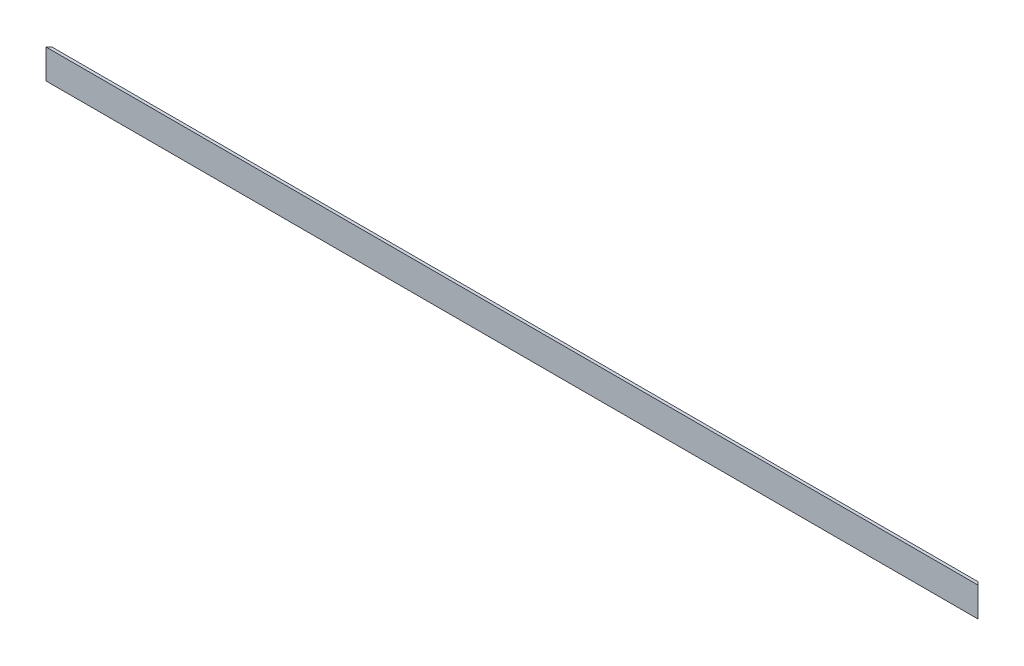
ISO-10303-21;
HEADER;
FILE_DESCRIPTION(('STEP AP214'),'2;1');
FILE_NAME('part.step','',(''),(''),'','','');
FILE_SCHEMA(('AUTOMOTIVE_DESIGN { 1 0 10303 214 1 1 1 1 }'));
ENDSEC;
DATA;
#1=APPLICATION_CONTEXT('core data for automotive mechanical design processes');
#2=APPLICATION_PROTOCOL_DEFINITION('international standard','automotive_design',2000,#1);
#3=PRODUCT_CONTEXT('',#1,'mechanical');
#4=PRODUCT('Part','Part','',(#3));
#5=PRODUCT_RELATED_PRODUCT_CATEGORY('part','',(#4));
#6=PRODUCT_DEFINITION_FORMATION('','',#4);
#7=PRODUCT_DEFINITION_CONTEXT('part definition',#1,'design');
#8=PRODUCT_DEFINITION('design','',#6,#7);
#9=PRODUCT_DEFINITION_SHAPE('','',#8);
#10=(LENGTH_UNIT() NAMED_UNIT(*) SI_UNIT(.MILLI.,.METRE.));
#11=(NAMED_UNIT(*) PLANE_ANGLE_UNIT() SI_UNIT($,.RADIAN.));
#12=(NAMED_UNIT(*) SI_UNIT($,.STERADIAN.) SOLID_ANGLE_UNIT());
#13=UNCERTAINTY_MEASURE_WITH_UNIT(LENGTH_MEASURE(1.E-05),#10,'distance_accuracy_value','');
#14=(GEOMETRIC_REPRESENTATION_CONTEXT(3) GLOBAL_UNCERTAINTY_ASSIGNED_CONTEXT((#13)) GLOBAL_UNIT_ASSIGNED_CONTEXT((#10,
#11,#12)) REPRESENTATION_CONTEXT('',''));
#15=CARTESIAN_POINT('',(0.,0.,0.));
#16=DIRECTION('',(0.,0.,1.));
#17=DIRECTION('',(1.,0.,0.));
#18=AXIS2_PLACEMENT_3D('',#15,#16,#17);
#19=CARTESIAN_POINT('',(475.,0.,-15.));
#20=DIRECTION('',(0.,1.,0.));
#21=DIRECTION('',(0.,0.,1.));
#22=AXIS2_PLACEMENT_3D('',#19,#20,#21);
#23=PLANE('',#22);
#24=DIRECTION('',(0.707106781186541,0.,-0.707106781186554));
#25=VECTOR('',#24,1.);
#26=CARTESIAN_POINT('',(0.,0.,0.));
#27=LINE('',#26,#25);
#28=CARTESIAN_POINT('',(0.,0.,0.));
#29=VERTEX_POINT('',#28);
#30=CARTESIAN_POINT('',(14.9999999999997,0.,-15.));
#31=VERTEX_POINT('',#30);
#32=EDGE_CURVE('E88',#29,#31,#27,.T.);
#33=ORIENTED_EDGE('',*,*,#32,.T.);
#34=DIRECTION('',(-1.,0.,0.));
#35=VECTOR('',#34,1.);
#36=CARTESIAN_POINT('',(475.,0.,-15.));
#37=LINE('',#36,#35);
#38=CARTESIAN_POINT('',(460.,0.,-15.));
#39=VERTEX_POINT('',#38);
#40=EDGE_CURVE('E11',#39,#31,#37,.T.);
#41=ORIENTED_EDGE('',*,*,#40,.F.);
#42=DIRECTION('',(-0.707106781186541,0.,-0.707106781186554));
#43=VECTOR('',#42,1.);
#44=CARTESIAN_POINT('',(475.,0.,0.));
#45=LINE('',#44,#43);
#46=CARTESIAN_POINT('',(475.,0.,0.));
#47=VERTEX_POINT('',#46);
#48=EDGE_CURVE('E128',#47,#39,#45,.T.);
#49=ORIENTED_EDGE('',*,*,#48,.F.);
#50=DIRECTION('',(-1.,0.,0.));
#51=VECTOR('',#50,1.);
#52=CARTESIAN_POINT('',(475.,0.,0.));
#53=LINE('',#52,#51);
#54=EDGE_CURVE('E106',#47,#29,#53,.T.);
#55=ORIENTED_EDGE('',*,*,#54,.T.);
#56=EDGE_LOOP('',(#33,#41,#49,#55));
#57=FACE_BOUND('',#56,.T.);
#58=ADVANCED_FACE('F35',(#57),#23,.F.);
#59=CARTESIAN_POINT('',(475.,1.49999999999998,-15.));
#60=DIRECTION('',(0.,0.,1.));
#61=DIRECTION('',(1.,0.,0.));
#62=AXIS2_PLACEMENT_3D('',#59,#60,#61);
#63=PLANE('',#62);
#64=DIRECTION('',(0.,-1.,0.));
#65=VECTOR('',#64,1.);
#66=CARTESIAN_POINT('',(14.9999999999997,1.49999999999948,-15.));
#67=LINE('',#66,#65);
#68=CARTESIAN_POINT('',(14.9999999999997,1.49999999999998,-15.));
#69=VERTEX_POINT('',#68);
#70=EDGE_CURVE('E127',#69,#31,#67,.T.);
#71=ORIENTED_EDGE('',*,*,#70,.F.);
#72=DIRECTION('',(-1.,0.,0.));
#73=VECTOR('',#72,1.);
#74=CARTESIAN_POINT('',(475.,1.49999999999998,-15.));
#75=LINE('',#74,#73);
#76=CARTESIAN_POINT('',(460.,1.49999999999998,-15.));
#77=VERTEX_POINT('',#76);
#78=EDGE_CURVE('E43',#77,#69,#75,.T.);
#79=ORIENTED_EDGE('',*,*,#78,.F.);
#80=DIRECTION('',(0.,-1.,0.));
#81=VECTOR('',#80,1.);
#82=CARTESIAN_POINT('',(460.,1.5,-15.));
#83=LINE('',#82,#81);
#84=EDGE_CURVE('E94',#77,#39,#83,.T.);
#85=ORIENTED_EDGE('',*,*,#84,.T.);
#86=ORIENTED_EDGE('',*,*,#40,.T.);
#87=EDGE_LOOP('',(#71,#79,#85,#86));
#88=FACE_BOUND('',#87,.T.);
#89=ADVANCED_FACE('F125',(#88),#63,.F.);
#90=CARTESIAN_POINT('',(475.,1.5,-1.50000000000002));
#91=DIRECTION('',(0.,-1.,0.));
#92=DIRECTION('',(0.,0.,-1.));
#93=AXIS2_PLACEMENT_3D('',#90,#91,#92);
#94=PLANE('',#93);
#95=DIRECTION('',(0.707106781186541,0.,-0.707106781186553));
#96=VECTOR('',#95,1.);
#97=CARTESIAN_POINT('',(238.249999999996,1.49999999999971,-238.25));
#98=LINE('',#97,#96);
#99=CARTESIAN_POINT('',(1.50000000000004,1.5,-1.50000000000002));
#100=VERTEX_POINT('',#99);
#101=EDGE_CURVE('E120',#100,#69,#98,.T.);
#102=ORIENTED_EDGE('',*,*,#101,.F.);
#103=DIRECTION('',(-1.,0.,0.));
#104=VECTOR('',#103,1.);
#105=CARTESIAN_POINT('',(475.,1.5,-1.50000000000002));
#106=LINE('',#105,#104);
#107=CARTESIAN_POINT('',(473.5,1.5,-1.50000000000002));
#108=VERTEX_POINT('',#107);
#109=EDGE_CURVE('E108',#108,#100,#106,.T.);
#110=ORIENTED_EDGE('',*,*,#109,.F.);
#111=DIRECTION('',(-0.707106781186541,0.,-0.707106781186554));
#112=VECTOR('',#111,1.);
#113=CARTESIAN_POINT('',(474.25,1.5,-0.750000000000025));
#114=LINE('',#113,#112);
#115=EDGE_CURVE('E121',#108,#77,#114,.T.);
#116=ORIENTED_EDGE('',*,*,#115,.T.);
#117=ORIENTED_EDGE('',*,*,#78,.T.);
#118=EDGE_LOOP('',(#102,#110,#116,#117));
#119=FACE_BOUND('',#118,.T.);
#120=ADVANCED_FACE('F118',(#119),#94,.F.);
#121=CARTESIAN_POINT('',(475.,15.,-1.5));
#122=DIRECTION('',(0.,0.,1.));
#123=DIRECTION('',(0.,-1.,0.));
#124=AXIS2_PLACEMENT_3D('',#121,#122,#123);
#125=PLANE('',#124);
#126=DIRECTION('',(0.,-1.,0.));
#127=VECTOR('',#126,1.);
#128=CARTESIAN_POINT('',(1.5,14.9999999999987,-1.5));
#129=LINE('',#128,#127);
#130=CARTESIAN_POINT('',(1.49999999999999,15.,-1.50000000000004));
#131=VERTEX_POINT('',#130);
#132=EDGE_CURVE('E103',#131,#100,#129,.T.);
#133=ORIENTED_EDGE('',*,*,#132,.F.);
#134=DIRECTION('',(-1.,0.,0.));
#135=VECTOR('',#134,1.);
#136=CARTESIAN_POINT('',(475.,15.,-1.5));
#137=LINE('',#136,#135);
#138=CARTESIAN_POINT('',(473.5,15.,-1.49999999999999));
#139=VERTEX_POINT('',#138);
#140=EDGE_CURVE('E102',#139,#131,#137,.T.);
#141=ORIENTED_EDGE('',*,*,#140,.F.);
#142=DIRECTION('',(0.,-1.,0.));
#143=VECTOR('',#142,1.);
#144=CARTESIAN_POINT('',(473.5,15.,-1.5));
#145=LINE('',#144,#143);
#146=EDGE_CURVE('E134',#139,#108,#145,.T.);
#147=ORIENTED_EDGE('',*,*,#146,.T.);
#148=ORIENTED_EDGE('',*,*,#109,.T.);
#149=EDGE_LOOP('',(#133,#141,#147,#148));
#150=FACE_BOUND('',#149,.T.);
#151=ADVANCED_FACE('F145',(#150),#125,.F.);
#152=CARTESIAN_POINT('',(475.,15.,0.));
#153=DIRECTION('',(0.,-1.,0.));
#154=DIRECTION('',(0.,0.,-1.));
#155=AXIS2_PLACEMENT_3D('',#152,#153,#154);
#156=PLANE('',#155);
#157=DIRECTION('',(0.707106781186541,0.,-0.707106781186554));
#158=VECTOR('',#157,1.);
#159=CARTESIAN_POINT('',(0.,15.,0.));
#160=LINE('',#159,#158);
#161=CARTESIAN_POINT('',(0.,15.,0.));
#162=VERTEX_POINT('',#161);
#163=EDGE_CURVE('E85',#162,#131,#160,.T.);
#164=ORIENTED_EDGE('',*,*,#163,.F.);
#165=DIRECTION('',(-1.,0.,0.));
#166=VECTOR('',#165,1.);
#167=CARTESIAN_POINT('',(475.,15.,0.));
#168=LINE('',#167,#166);
#169=CARTESIAN_POINT('',(475.,15.,0.));
#170=VERTEX_POINT('',#169);
#171=EDGE_CURVE('E99',#170,#162,#168,.T.);
#172=ORIENTED_EDGE('',*,*,#171,.F.);
#173=DIRECTION('',(-0.707106781186541,0.,-0.707106781186554));
#174=VECTOR('',#173,1.);
#175=CARTESIAN_POINT('',(475.,15.,0.));
#176=LINE('',#175,#174);
#177=EDGE_CURVE('E49',#170,#139,#176,.T.);
#178=ORIENTED_EDGE('',*,*,#177,.T.);
#179=ORIENTED_EDGE('',*,*,#140,.T.);
#180=EDGE_LOOP('',(#164,#172,#178,#179));
#181=FACE_BOUND('',#180,.T.);
#182=ADVANCED_FACE('F98',(#181),#156,.F.);
#183=CARTESIAN_POINT('',(475.,0.,0.));
#184=DIRECTION('',(0.,0.,-1.));
#185=DIRECTION('',(-1.,0.,0.));
#186=AXIS2_PLACEMENT_3D('',#183,#184,#185);
#187=PLANE('',#186);
#188=DIRECTION('',(0.,-1.,0.));
#189=VECTOR('',#188,1.);
#190=CARTESIAN_POINT('',(0.,0.,0.));
#191=LINE('',#190,#189);
#192=EDGE_CURVE('E82',#162,#29,#191,.T.);
#193=ORIENTED_EDGE('',*,*,#192,.T.);
#194=ORIENTED_EDGE('',*,*,#54,.F.);
#195=DIRECTION('',(0.,-1.,0.));
#196=VECTOR('',#195,1.);
#197=CARTESIAN_POINT('',(475.,0.,0.));
#198=LINE('',#197,#196);
#199=EDGE_CURVE('E93',#170,#47,#198,.T.);
#200=ORIENTED_EDGE('',*,*,#199,.F.);
#201=ORIENTED_EDGE('',*,*,#171,.T.);
#202=EDGE_LOOP('',(#193,#194,#200,#201));
#203=FACE_BOUND('',#202,.T.);
#204=ADVANCED_FACE('F105',(#203),#187,.F.);
#205=CARTESIAN_POINT('',(475.,15.,0.));
#206=DIRECTION('',(-0.707106781186554,0.,0.707106781186541));
#207=DIRECTION('',(0.707106781186541,0.,0.707106781186554));
#208=AXIS2_PLACEMENT_3D('',#205,#206,#207);
#209=PLANE('',#208);
#210=ORIENTED_EDGE('',*,*,#115,.F.);
#211=ORIENTED_EDGE('',*,*,#146,.F.);
#212=ORIENTED_EDGE('',*,*,#177,.F.);
#213=ORIENTED_EDGE('',*,*,#199,.T.);
#214=ORIENTED_EDGE('',*,*,#48,.T.);
#215=ORIENTED_EDGE('',*,*,#84,.F.);
#216=EDGE_LOOP('',(#210,#211,#212,#213,#214,#215));
#217=FACE_BOUND('',#216,.T.);
#218=ADVANCED_FACE('F141',(#217),#209,.F.);
#219=CARTESIAN_POINT('',(0.,15.,0.));
#220=DIRECTION('',(-0.707106781186553,0.,-0.707106781186541));
#221=DIRECTION('',(-0.707106781186542,0.,0.707106781186554));
#222=AXIS2_PLACEMENT_3D('',#219,#220,#221);
#223=PLANE('',#222);
#224=ORIENTED_EDGE('',*,*,#70,.T.);
#225=ORIENTED_EDGE('',*,*,#32,.F.);
#226=ORIENTED_EDGE('',*,*,#192,.F.);
#227=ORIENTED_EDGE('',*,*,#163,.T.);
#228=ORIENTED_EDGE('',*,*,#132,.T.);
#229=ORIENTED_EDGE('',*,*,#101,.T.);
#230=EDGE_LOOP('',(#224,#225,#226,#227,#228,#229));
#231=FACE_BOUND('',#230,.T.);
#232=ADVANCED_FACE('F84',(#231),#223,.T.);
#233=CLOSED_SHELL('',(#58,#89,#120,#151,#182,#204,#218,#232));
#234=MANIFOLD_SOLID_BREP('B2',#233);
#235=ADVANCED_BREP_SHAPE_REPRESENTATION('',(#18,#234),#14);
#236=SHAPE_DEFINITION_REPRESENTATION(#9,#235);
ENDSEC;
END-ISO-10303-21;
